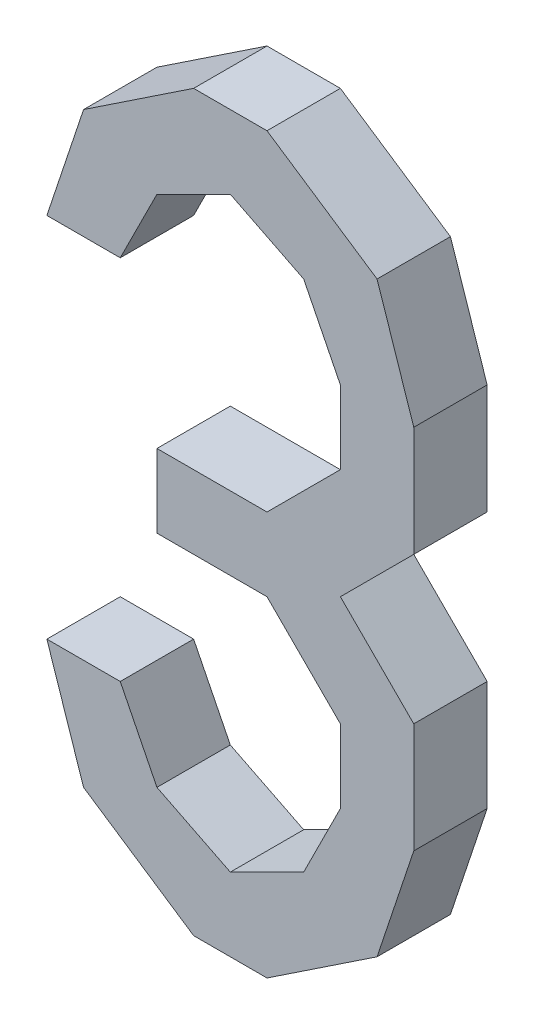
ISO-10303-21;
HEADER;
FILE_DESCRIPTION(('STEP AP214'),'2;1');
FILE_NAME('part.step','',(''),(''),'','','');
FILE_SCHEMA(('AUTOMOTIVE_DESIGN { 1 0 10303 214 1 1 1 1 }'));
ENDSEC;
DATA;
#1=APPLICATION_CONTEXT('core data for automotive mechanical design processes');
#2=APPLICATION_PROTOCOL_DEFINITION('international standard','automotive_design',2000,#1);
#3=PRODUCT_CONTEXT('',#1,'mechanical');
#4=PRODUCT('Part','Part','',(#3));
#5=PRODUCT_RELATED_PRODUCT_CATEGORY('part','',(#4));
#6=PRODUCT_DEFINITION_FORMATION('','',#4);
#7=PRODUCT_DEFINITION_CONTEXT('part definition',#1,'design');
#8=PRODUCT_DEFINITION('design','',#6,#7);
#9=PRODUCT_DEFINITION_SHAPE('','',#8);
#10=(LENGTH_UNIT() NAMED_UNIT(*) SI_UNIT(.MILLI.,.METRE.));
#11=(NAMED_UNIT(*) PLANE_ANGLE_UNIT() SI_UNIT($,.RADIAN.));
#12=(NAMED_UNIT(*) SI_UNIT($,.STERADIAN.) SOLID_ANGLE_UNIT());
#13=UNCERTAINTY_MEASURE_WITH_UNIT(LENGTH_MEASURE(1.E-05),#10,'distance_accuracy_value','');
#14=(GEOMETRIC_REPRESENTATION_CONTEXT(3) GLOBAL_UNCERTAINTY_ASSIGNED_CONTEXT((#13)) GLOBAL_UNIT_ASSIGNED_CONTEXT((#10,
#11,#12)) REPRESENTATION_CONTEXT('',''));
#15=CARTESIAN_POINT('',(0.,0.,0.));
#16=DIRECTION('',(0.,0.,1.));
#17=DIRECTION('',(1.,0.,0.));
#18=AXIS2_PLACEMENT_3D('',#15,#16,#17);
#19=CARTESIAN_POINT('',(-0.06349999999999,0.0635,0.));
#20=DIRECTION('',(0.,0.,1.));
#21=DIRECTION('',(1.,0.,0.));
#22=AXIS2_PLACEMENT_3D('',#19,#20,#21);
#23=PLANE('',#22);
#24=DIRECTION('',(-0.832050294337997,-0.554700196224998,0.));
#25=VECTOR('',#24,1.);
#26=CARTESIAN_POINT('',(-0.0508,0.1016,0.));
#27=LINE('',#26,#25);
#28=CARTESIAN_POINT('',(-0.0126999999999982,0.126999999999997,0.));
#29=VERTEX_POINT('',#28);
#30=CARTESIAN_POINT('',(-0.0507999999999977,0.101599999999999,0.));
#31=VERTEX_POINT('',#30);
#32=EDGE_CURVE('E376',#29,#31,#27,.T.);
#33=ORIENTED_EDGE('',*,*,#32,.F.);
#34=DIRECTION('',(1.,0.,0.));
#35=VECTOR('',#34,1.);
#36=CARTESIAN_POINT('',(-0.0127,0.127,0.));
#37=LINE('',#36,#35);
#38=CARTESIAN_POINT('',(0.01270000000001,0.127,0.));
#39=VERTEX_POINT('',#38);
#40=EDGE_CURVE('E371',#39,#29,#37,.F.);
#41=ORIENTED_EDGE('',*,*,#40,.F.);
#42=DIRECTION('',(-0.832050294337997,0.554700196224998,0.));
#43=VECTOR('',#42,1.);
#44=CARTESIAN_POINT('',(0.01270000000001,0.127,0.));
#45=LINE('',#44,#43);
#46=CARTESIAN_POINT('',(0.0508000000000118,0.101600000000003,0.));
#47=VERTEX_POINT('',#46);
#48=EDGE_CURVE('E366',#47,#39,#45,.T.);
#49=ORIENTED_EDGE('',*,*,#48,.F.);
#50=DIRECTION('',(-0.316227766016838,0.948683298050514,0.));
#51=VECTOR('',#50,1.);
#52=CARTESIAN_POINT('',(0.05080000000001,0.1016,0.));
#53=LINE('',#52,#51);
#54=CARTESIAN_POINT('',(0.0635000000000022,0.0635000000000008,0.));
#55=VERTEX_POINT('',#54);
#56=EDGE_CURVE('E361',#55,#47,#53,.T.);
#57=ORIENTED_EDGE('',*,*,#56,.F.);
#58=DIRECTION('',(0.,1.,0.));
#59=VECTOR('',#58,1.);
#60=CARTESIAN_POINT('',(0.0635,0.0635,0.));
#61=LINE('',#60,#59);
#62=CARTESIAN_POINT('',(0.0635,0.02540000000002,0.));
#63=VERTEX_POINT('',#62);
#64=EDGE_CURVE('E356',#63,#55,#61,.T.);
#65=ORIENTED_EDGE('',*,*,#64,.F.);
#66=DIRECTION('',(0.707106781186048,0.707106781187048,0.));
#67=VECTOR('',#66,1.);
#68=CARTESIAN_POINT('',(0.0635,0.02540000000002,0.));
#69=LINE('',#68,#67);
#70=CARTESIAN_POINT('',(0.038100000000002,0.,0.));
#71=VERTEX_POINT('',#70);
#72=EDGE_CURVE('E351',#71,#63,#69,.T.);
#73=ORIENTED_EDGE('',*,*,#72,.F.);
#74=DIRECTION('',(-0.707106781187048,0.707106781186048,0.));
#75=VECTOR('',#74,1.);
#76=CARTESIAN_POINT('',(0.0381,0.,0.));
#77=LINE('',#76,#75);
#78=CARTESIAN_POINT('',(0.0635000000000032,-0.0253999999999868,0.));
#79=VERTEX_POINT('',#78);
#80=EDGE_CURVE('E346',#79,#71,#77,.T.);
#81=ORIENTED_EDGE('',*,*,#80,.F.);
#82=DIRECTION('',(0.,1.,0.));
#83=VECTOR('',#82,1.);
#84=CARTESIAN_POINT('',(0.0635,-0.02539999999999,0.));
#85=LINE('',#84,#83);
#86=CARTESIAN_POINT('',(0.0635,-0.0635,0.));
#87=VERTEX_POINT('',#86);
#88=EDGE_CURVE('E341',#87,#79,#85,.T.);
#89=ORIENTED_EDGE('',*,*,#88,.F.);
#90=DIRECTION('',(0.316227766016838,0.948683298050514,0.));
#91=VECTOR('',#90,1.);
#92=CARTESIAN_POINT('',(0.0635,-0.0635,0.));
#93=LINE('',#92,#91);
#94=CARTESIAN_POINT('',(0.0508000000000077,-0.101599999999999,0.));
#95=VERTEX_POINT('',#94);
#96=EDGE_CURVE('E336',#95,#87,#93,.T.);
#97=ORIENTED_EDGE('',*,*,#96,.F.);
#98=DIRECTION('',(0.832050294337997,0.554700196224998,0.));
#99=VECTOR('',#98,1.);
#100=CARTESIAN_POINT('',(0.05080000000001,-0.1016,0.));
#101=LINE('',#100,#99);
#102=CARTESIAN_POINT('',(0.0127000000000083,-0.126999999999997,0.));
#103=VERTEX_POINT('',#102);
#104=EDGE_CURVE('E331',#103,#95,#101,.T.);
#105=ORIENTED_EDGE('',*,*,#104,.F.);
#106=DIRECTION('',(1.,0.,0.));
#107=VECTOR('',#106,1.);
#108=CARTESIAN_POINT('',(0.01270000000001,-0.127,0.));
#109=LINE('',#108,#107);
#110=CARTESIAN_POINT('',(-0.0127,-0.127,0.));
#111=VERTEX_POINT('',#110);
#112=EDGE_CURVE('E326',#111,#103,#109,.T.);
#113=ORIENTED_EDGE('',*,*,#112,.F.);
#114=DIRECTION('',(0.832050294337997,-0.554700196224998,0.));
#115=VECTOR('',#114,1.);
#116=CARTESIAN_POINT('',(-0.0127,-0.127,0.));
#117=LINE('',#116,#115);
#118=CARTESIAN_POINT('',(-0.0508000000000018,-0.101600000000003,0.));
#119=VERTEX_POINT('',#118);
#120=EDGE_CURVE('E321',#119,#111,#117,.T.);
#121=ORIENTED_EDGE('',*,*,#120,.F.);
#122=DIRECTION('',(0.316227766016838,-0.948683298050514,0.));
#123=VECTOR('',#122,1.);
#124=CARTESIAN_POINT('',(-0.0508,-0.1016,0.));
#125=LINE('',#124,#123);
#126=CARTESIAN_POINT('',(-0.0634999999999922,-0.0635000000000008,0.));
#127=VERTEX_POINT('',#126);
#128=EDGE_CURVE('E316',#127,#119,#125,.T.);
#129=ORIENTED_EDGE('',*,*,#128,.F.);
#130=DIRECTION('',(1.,0.,0.));
#131=VECTOR('',#130,1.);
#132=CARTESIAN_POINT('',(-0.06349999999999,-0.0635,0.));
#133=LINE('',#132,#131);
#134=CARTESIAN_POINT('',(-0.0381,-0.0635,0.));
#135=VERTEX_POINT('',#134);
#136=EDGE_CURVE('E311',#135,#127,#133,.F.);
#137=ORIENTED_EDGE('',*,*,#136,.F.);
#138=DIRECTION('',(-0.447213595499958,0.894427190999916,0.));
#139=VECTOR('',#138,1.);
#140=CARTESIAN_POINT('',(-0.0381,-0.0635,0.));
#141=LINE('',#140,#139);
#142=CARTESIAN_POINT('',(-0.025399999999992,-0.088900000000001,0.));
#143=VERTEX_POINT('',#142);
#144=EDGE_CURVE('E306',#143,#135,#141,.T.);
#145=ORIENTED_EDGE('',*,*,#144,.F.);
#146=DIRECTION('',(-0.894427190999916,0.447213595499958,0.));
#147=VECTOR('',#146,1.);
#148=CARTESIAN_POINT('',(-0.02539999999999,-0.0889,0.));
#149=LINE('',#148,#147);
#150=CARTESIAN_POINT('',(0.,-0.101599999999999,0.));
#151=VERTEX_POINT('',#150);
#152=EDGE_CURVE('E301',#151,#143,#149,.T.);
#153=ORIENTED_EDGE('',*,*,#152,.F.);
#154=DIRECTION('',(-0.894427190999916,-0.447213595499958,0.));
#155=VECTOR('',#154,1.);
#156=CARTESIAN_POINT('',(0.,-0.1016,0.));
#157=LINE('',#156,#155);
#158=CARTESIAN_POINT('',(0.0254,-0.0889,0.));
#159=VERTEX_POINT('',#158);
#160=EDGE_CURVE('E296',#159,#151,#157,.T.);
#161=ORIENTED_EDGE('',*,*,#160,.F.);
#162=DIRECTION('',(-0.447213595499958,-0.894427190999916,0.));
#163=VECTOR('',#162,1.);
#164=CARTESIAN_POINT('',(0.0254,-0.0889,0.));
#165=LINE('',#164,#163);
#166=CARTESIAN_POINT('',(0.0381,-0.0635,0.));
#167=VERTEX_POINT('',#166);
#168=EDGE_CURVE('E291',#167,#159,#165,.T.);
#169=ORIENTED_EDGE('',*,*,#168,.F.);
#170=DIRECTION('',(0.,1.,0.));
#171=VECTOR('',#170,1.);
#172=CARTESIAN_POINT('',(0.0381,-0.0635,0.));
#173=LINE('',#172,#171);
#174=CARTESIAN_POINT('',(0.0381,-0.03809999999999,0.));
#175=VERTEX_POINT('',#174);
#176=EDGE_CURVE('E286',#175,#167,#173,.F.);
#177=ORIENTED_EDGE('',*,*,#176,.F.);
#178=DIRECTION('',(0.707106781186548,-0.707106781186548,0.));
#179=VECTOR('',#178,1.);
#180=CARTESIAN_POINT('',(0.0381,-0.03809999999999,0.));
#181=LINE('',#180,#179);
#182=CARTESIAN_POINT('',(0.01270000000001,-0.0127,0.));
#183=VERTEX_POINT('',#182);
#184=EDGE_CURVE('E281',#183,#175,#181,.T.);
#185=ORIENTED_EDGE('',*,*,#184,.F.);
#186=DIRECTION('',(1.,0.,0.));
#187=VECTOR('',#186,1.);
#188=CARTESIAN_POINT('',(0.01270000000001,-0.0127,0.));
#189=LINE('',#188,#187);
#190=CARTESIAN_POINT('',(-0.02539999999999,-0.0127,0.));
#191=VERTEX_POINT('',#190);
#192=EDGE_CURVE('E276',#191,#183,#189,.T.);
#193=ORIENTED_EDGE('',*,*,#192,.F.);
#194=DIRECTION('',(0.,1.,0.));
#195=VECTOR('',#194,1.);
#196=CARTESIAN_POINT('',(-0.02539999999999,-0.0127,0.));
#197=LINE('',#196,#195);
#198=CARTESIAN_POINT('',(-0.02539999999999,0.0127,0.));
#199=VERTEX_POINT('',#198);
#200=EDGE_CURVE('E271',#199,#191,#197,.F.);
#201=ORIENTED_EDGE('',*,*,#200,.F.);
#202=DIRECTION('',(1.,0.,0.));
#203=VECTOR('',#202,1.);
#204=CARTESIAN_POINT('',(-0.02539999999999,0.0127,0.));
#205=LINE('',#204,#203);
#206=CARTESIAN_POINT('',(0.01270000000001,0.0127,0.));
#207=VERTEX_POINT('',#206);
#208=EDGE_CURVE('E266',#207,#199,#205,.F.);
#209=ORIENTED_EDGE('',*,*,#208,.F.);
#210=DIRECTION('',(-0.707106781186048,-0.707106781187048,0.));
#211=VECTOR('',#210,1.);
#212=CARTESIAN_POINT('',(0.01270000000001,0.0127,0.));
#213=LINE('',#212,#211);
#214=CARTESIAN_POINT('',(0.038099999999998,0.038100000000012,0.));
#215=VERTEX_POINT('',#214);
#216=EDGE_CURVE('E261',#215,#207,#213,.T.);
#217=ORIENTED_EDGE('',*,*,#216,.F.);
#218=DIRECTION('',(0.,1.,0.));
#219=VECTOR('',#218,1.);
#220=CARTESIAN_POINT('',(0.0381,0.03810000000001,0.));
#221=LINE('',#220,#219);
#222=CARTESIAN_POINT('',(0.0381,0.0635,0.));
#223=VERTEX_POINT('',#222);
#224=EDGE_CURVE('E256',#223,#215,#221,.F.);
#225=ORIENTED_EDGE('',*,*,#224,.F.);
#226=DIRECTION('',(0.447213595499958,-0.894427190999916,0.));
#227=VECTOR('',#226,1.);
#228=CARTESIAN_POINT('',(0.0381,0.0635,0.));
#229=LINE('',#228,#227);
#230=CARTESIAN_POINT('',(0.0254,0.0889,0.));
#231=VERTEX_POINT('',#230);
#232=EDGE_CURVE('E251',#231,#223,#229,.T.);
#233=ORIENTED_EDGE('',*,*,#232,.F.);
#234=DIRECTION('',(0.894427190999516,-0.447213595500758,0.));
#235=VECTOR('',#234,1.);
#236=CARTESIAN_POINT('',(0.0254,0.0889,0.));
#237=LINE('',#236,#235);
#238=CARTESIAN_POINT('',(0.,0.101600000000006,0.));
#239=VERTEX_POINT('',#238);
#240=EDGE_CURVE('E246',#239,#231,#237,.T.);
#241=ORIENTED_EDGE('',*,*,#240,.F.);
#242=DIRECTION('',(0.894427190999516,0.447213595500758,0.));
#243=VECTOR('',#242,1.);
#244=CARTESIAN_POINT('',(0.,0.1016,0.));
#245=LINE('',#244,#243);
#246=CARTESIAN_POINT('',(-0.0253999999999877,0.0888999999999953,0.));
#247=VERTEX_POINT('',#246);
#248=EDGE_CURVE('E232',#247,#239,#245,.T.);
#249=ORIENTED_EDGE('',*,*,#248,.F.);
#250=DIRECTION('',(0.447213595499958,0.894427190999916,0.));
#251=VECTOR('',#250,1.);
#252=CARTESIAN_POINT('',(-0.02539999999999,0.0889,0.));
#253=LINE('',#252,#251);
#254=CARTESIAN_POINT('',(-0.038099999999998,0.063499999999999,0.));
#255=VERTEX_POINT('',#254);
#256=EDGE_CURVE('E217',#255,#247,#253,.T.);
#257=ORIENTED_EDGE('',*,*,#256,.F.);
#258=DIRECTION('',(1.,0.,0.));
#259=VECTOR('',#258,1.);
#260=CARTESIAN_POINT('',(-0.0381,0.0635,0.));
#261=LINE('',#260,#259);
#262=CARTESIAN_POINT('',(-0.06349999999999,0.0635,0.));
#263=VERTEX_POINT('',#262);
#264=EDGE_CURVE('E20',#263,#255,#261,.T.);
#265=ORIENTED_EDGE('',*,*,#264,.F.);
#266=DIRECTION('',(-0.316227766016838,-0.948683298050514,0.));
#267=VECTOR('',#266,1.);
#268=CARTESIAN_POINT('',(-0.06349999999999,0.0635,0.));
#269=LINE('',#268,#267);
#270=EDGE_CURVE('E380',#31,#263,#269,.T.);
#271=ORIENTED_EDGE('',*,*,#270,.F.);
#272=EDGE_LOOP('',(#33,#41,#49,#57,#65,#73,#81,#89,#97,#105,#113,#121,#129,#137,#145,#153,#161,
#169,#177,#185,#193,#201,#209,#217,#225,#233,#241,#249,#257,#265,#271));
#273=FACE_BOUND('',#272,.T.);
#274=ADVANCED_FACE('F17',(#273),#23,.F.);
#275=CARTESIAN_POINT('',(-0.0381,0.0635,0.));
#276=DIRECTION('',(0.,-1.,0.));
#277=DIRECTION('',(0.,0.,-1.));
#278=AXIS2_PLACEMENT_3D('',#275,#276,#277);
#279=PLANE('',#278);
#280=DIRECTION('',(0.,0.,1.));
#281=VECTOR('',#280,1.);
#282=CARTESIAN_POINT('',(-0.06349999999999,0.0635,0.));
#283=LINE('',#282,#281);
#284=CARTESIAN_POINT('',(-0.06349999999999,0.0635,0.0254));
#285=VERTEX_POINT('',#284);
#286=EDGE_CURVE('E226',#263,#285,#283,.T.);
#287=ORIENTED_EDGE('',*,*,#286,.F.);
#288=ORIENTED_EDGE('',*,*,#264,.T.);
#289=DIRECTION('',(0.,0.,1.));
#290=VECTOR('',#289,1.);
#291=CARTESIAN_POINT('',(-0.038099999999992,0.063499999999996,0.));
#292=LINE('',#291,#290);
#293=CARTESIAN_POINT('',(-0.038099999999998,0.063499999999999,0.0254));
#294=VERTEX_POINT('',#293);
#295=EDGE_CURVE('E223',#294,#255,#292,.F.);
#296=ORIENTED_EDGE('',*,*,#295,.F.);
#297=DIRECTION('',(1.,0.,0.));
#298=VECTOR('',#297,1.);
#299=CARTESIAN_POINT('',(-0.06349999999999,0.0635,0.0254));
#300=LINE('',#299,#298);
#301=EDGE_CURVE('E382',#285,#294,#300,.T.);
#302=ORIENTED_EDGE('',*,*,#301,.F.);
#303=EDGE_LOOP('',(#287,#288,#296,#302));
#304=FACE_BOUND('',#303,.T.);
#305=ADVANCED_FACE('F222',(#304),#279,.T.);
#306=CARTESIAN_POINT('',(-0.02539999999999,0.0889,0.));
#307=DIRECTION('',(0.894427190999916,-0.447213595499958,0.));
#308=DIRECTION('',(0.447213595499958,0.894427190999916,0.));
#309=AXIS2_PLACEMENT_3D('',#306,#307,#308);
#310=PLANE('',#309);
#311=ORIENTED_EDGE('',*,*,#295,.T.);
#312=ORIENTED_EDGE('',*,*,#256,.T.);
#313=DIRECTION('',(0.,0.,1.));
#314=VECTOR('',#313,1.);
#315=CARTESIAN_POINT('',(-0.0253999999999806,0.0888999999999813,0.));
#316=LINE('',#315,#314);
#317=CARTESIAN_POINT('',(-0.0253999999999877,0.0888999999999953,0.0254));
#318=VERTEX_POINT('',#317);
#319=EDGE_CURVE('E234',#318,#247,#316,.F.);
#320=ORIENTED_EDGE('',*,*,#319,.F.);
#321=DIRECTION('',(0.44721359550024,0.894427190999775,0.));
#322=VECTOR('',#321,1.);
#323=CARTESIAN_POINT('',(-0.0381,0.0635,0.0254));
#324=LINE('',#323,#322);
#325=EDGE_CURVE('E238',#294,#318,#324,.T.);
#326=ORIENTED_EDGE('',*,*,#325,.F.);
#327=EDGE_LOOP('',(#311,#312,#320,#326));
#328=FACE_BOUND('',#327,.T.);
#329=ADVANCED_FACE('F236',(#328),#310,.T.);
#330=CARTESIAN_POINT('',(0.,0.1016,0.));
#331=DIRECTION('',(0.447213595500758,-0.894427190999516,0.));
#332=DIRECTION('',(0.894427190999516,0.447213595500758,0.));
#333=AXIS2_PLACEMENT_3D('',#330,#331,#332);
#334=PLANE('',#333);
#335=ORIENTED_EDGE('',*,*,#319,.T.);
#336=ORIENTED_EDGE('',*,*,#248,.T.);
#337=DIRECTION('',(0.,0.,1.));
#338=VECTOR('',#337,1.);
#339=CARTESIAN_POINT('',(0.,0.101600000000023,0.));
#340=LINE('',#339,#338);
#341=CARTESIAN_POINT('',(0.,0.101600000000006,0.0254));
#342=VERTEX_POINT('',#341);
#343=EDGE_CURVE('E243',#342,#239,#340,.F.);
#344=ORIENTED_EDGE('',*,*,#343,.F.);
#345=DIRECTION('',(0.894427190999845,0.447213595500099,0.));
#346=VECTOR('',#345,1.);
#347=CARTESIAN_POINT('',(-0.02539999999999,0.0889,0.0254));
#348=LINE('',#347,#346);
#349=EDGE_CURVE('E385',#318,#342,#348,.T.);
#350=ORIENTED_EDGE('',*,*,#349,.F.);
#351=EDGE_LOOP('',(#335,#336,#344,#350));
#352=FACE_BOUND('',#351,.T.);
#353=ADVANCED_FACE('F588',(#352),#334,.T.);
#354=CARTESIAN_POINT('',(0.0254,0.0889,0.));
#355=DIRECTION('',(-0.447213595500758,-0.894427190999516,0.));
#356=DIRECTION('',(0.894427190999516,-0.447213595500758,0.));
#357=AXIS2_PLACEMENT_3D('',#354,#355,#356);
#358=PLANE('',#357);
#359=ORIENTED_EDGE('',*,*,#343,.T.);
#360=ORIENTED_EDGE('',*,*,#240,.T.);
#361=DIRECTION('',(0.,0.,1.));
#362=VECTOR('',#361,1.);
#363=CARTESIAN_POINT('',(0.0254,0.0889,0.));
#364=LINE('',#363,#362);
#365=CARTESIAN_POINT('',(0.0254,0.0889,0.0254));
#366=VERTEX_POINT('',#365);
#367=EDGE_CURVE('E248',#366,#231,#364,.F.);
#368=ORIENTED_EDGE('',*,*,#367,.F.);
#369=DIRECTION('',(0.894427190999916,-0.447213595499958,0.));
#370=VECTOR('',#369,1.);
#371=CARTESIAN_POINT('',(0.,0.1016,0.0254));
#372=LINE('',#371,#370);
#373=EDGE_CURVE('E388',#342,#366,#372,.T.);
#374=ORIENTED_EDGE('',*,*,#373,.F.);
#375=EDGE_LOOP('',(#359,#360,#368,#374));
#376=FACE_BOUND('',#375,.T.);
#377=ADVANCED_FACE('F584',(#376),#358,.T.);
#378=CARTESIAN_POINT('',(0.0381,0.0635,0.));
#379=DIRECTION('',(-0.894427190999916,-0.447213595499958,0.));
#380=DIRECTION('',(0.447213595499958,-0.894427190999916,0.));
#381=AXIS2_PLACEMENT_3D('',#378,#379,#380);
#382=PLANE('',#381);
#383=ORIENTED_EDGE('',*,*,#367,.T.);
#384=ORIENTED_EDGE('',*,*,#232,.T.);
#385=DIRECTION('',(0.,0.,1.));
#386=VECTOR('',#385,1.);
#387=CARTESIAN_POINT('',(0.0381,0.0635,0.));
#388=LINE('',#387,#386);
#389=CARTESIAN_POINT('',(0.0381,0.0635,0.0254));
#390=VERTEX_POINT('',#389);
#391=EDGE_CURVE('E253',#390,#223,#388,.F.);
#392=ORIENTED_EDGE('',*,*,#391,.F.);
#393=DIRECTION('',(0.447213595499958,-0.894427190999916,0.));
#394=VECTOR('',#393,1.);
#395=CARTESIAN_POINT('',(0.0254,0.0889,0.0254));
#396=LINE('',#395,#394);
#397=EDGE_CURVE('E391',#366,#390,#396,.T.);
#398=ORIENTED_EDGE('',*,*,#397,.F.);
#399=EDGE_LOOP('',(#383,#384,#392,#398));
#400=FACE_BOUND('',#399,.T.);
#401=ADVANCED_FACE('F580',(#400),#382,.T.);
#402=CARTESIAN_POINT('',(0.0381,0.03810000000001,0.));
#403=DIRECTION('',(-1.,0.,0.));
#404=DIRECTION('',(0.,0.,1.));
#405=AXIS2_PLACEMENT_3D('',#402,#403,#404);
#406=PLANE('',#405);
#407=ORIENTED_EDGE('',*,*,#391,.T.);
#408=ORIENTED_EDGE('',*,*,#224,.T.);
#409=DIRECTION('',(0.,0.,1.));
#410=VECTOR('',#409,1.);
#411=CARTESIAN_POINT('',(0.038099999999992,0.038100000000018,0.));
#412=LINE('',#411,#410);
#413=CARTESIAN_POINT('',(0.038099999999998,0.038100000000012,0.0254));
#414=VERTEX_POINT('',#413);
#415=EDGE_CURVE('E258',#414,#215,#412,.F.);
#416=ORIENTED_EDGE('',*,*,#415,.F.);
#417=DIRECTION('',(0.,1.,0.));
#418=VECTOR('',#417,1.);
#419=CARTESIAN_POINT('',(0.0381,0.0635,0.0254));
#420=LINE('',#419,#418);
#421=EDGE_CURVE('E394',#390,#414,#420,.F.);
#422=ORIENTED_EDGE('',*,*,#421,.F.);
#423=EDGE_LOOP('',(#407,#408,#416,#422));
#424=FACE_BOUND('',#423,.T.);
#425=ADVANCED_FACE('F576',(#424),#406,.T.);
#426=CARTESIAN_POINT('',(0.01270000000001,0.0127,0.));
#427=DIRECTION('',(-0.707106781187048,0.707106781186048,0.));
#428=DIRECTION('',(-0.707106781186048,-0.707106781187048,0.));
#429=AXIS2_PLACEMENT_3D('',#426,#427,#428);
#430=PLANE('',#429);
#431=ORIENTED_EDGE('',*,*,#415,.T.);
#432=ORIENTED_EDGE('',*,*,#216,.T.);
#433=DIRECTION('',(0.,0.,1.));
#434=VECTOR('',#433,1.);
#435=CARTESIAN_POINT('',(0.01270000000001,0.0127,0.));
#436=LINE('',#435,#434);
#437=CARTESIAN_POINT('',(0.01270000000001,0.0127,0.0254));
#438=VERTEX_POINT('',#437);
#439=EDGE_CURVE('E263',#438,#207,#436,.F.);
#440=ORIENTED_EDGE('',*,*,#439,.F.);
#441=DIRECTION('',(-0.707106781186269,-0.707106781186826,0.));
#442=VECTOR('',#441,1.);
#443=CARTESIAN_POINT('',(0.0381,0.03810000000001,0.0254));
#444=LINE('',#443,#442);
#445=EDGE_CURVE('E397',#414,#438,#444,.T.);
#446=ORIENTED_EDGE('',*,*,#445,.F.);
#447=EDGE_LOOP('',(#431,#432,#440,#446));
#448=FACE_BOUND('',#447,.T.);
#449=ADVANCED_FACE('F572',(#448),#430,.T.);
#450=CARTESIAN_POINT('',(-0.02539999999999,0.0127,0.));
#451=DIRECTION('',(0.,1.,0.));
#452=DIRECTION('',(0.,0.,1.));
#453=AXIS2_PLACEMENT_3D('',#450,#451,#452);
#454=PLANE('',#453);
#455=ORIENTED_EDGE('',*,*,#439,.T.);
#456=ORIENTED_EDGE('',*,*,#208,.T.);
#457=DIRECTION('',(0.,0.,1.));
#458=VECTOR('',#457,1.);
#459=CARTESIAN_POINT('',(-0.02539999999999,0.0127,0.));
#460=LINE('',#459,#458);
#461=CARTESIAN_POINT('',(-0.02539999999999,0.0127,0.0254));
#462=VERTEX_POINT('',#461);
#463=EDGE_CURVE('E268',#462,#199,#460,.F.);
#464=ORIENTED_EDGE('',*,*,#463,.F.);
#465=DIRECTION('',(1.,0.,0.));
#466=VECTOR('',#465,1.);
#467=CARTESIAN_POINT('',(-0.06349999999999,0.0127,0.0254));
#468=LINE('',#467,#466);
#469=EDGE_CURVE('E400',#438,#462,#468,.F.);
#470=ORIENTED_EDGE('',*,*,#469,.F.);
#471=EDGE_LOOP('',(#455,#456,#464,#470));
#472=FACE_BOUND('',#471,.T.);
#473=ADVANCED_FACE('F568',(#472),#454,.T.);
#474=CARTESIAN_POINT('',(-0.02539999999999,-0.0127,0.));
#475=DIRECTION('',(-1.,0.,0.));
#476=DIRECTION('',(0.,0.,1.));
#477=AXIS2_PLACEMENT_3D('',#474,#475,#476);
#478=PLANE('',#477);
#479=ORIENTED_EDGE('',*,*,#463,.T.);
#480=ORIENTED_EDGE('',*,*,#200,.T.);
#481=DIRECTION('',(0.,0.,-1.));
#482=VECTOR('',#481,1.);
#483=CARTESIAN_POINT('',(-0.02539999999999,-0.0127,0.));
#484=LINE('',#483,#482);
#485=CARTESIAN_POINT('',(-0.02539999999999,-0.0127,0.0254));
#486=VERTEX_POINT('',#485);
#487=EDGE_CURVE('E273',#486,#191,#484,.T.);
#488=ORIENTED_EDGE('',*,*,#487,.F.);
#489=DIRECTION('',(0.,1.,0.));
#490=VECTOR('',#489,1.);
#491=CARTESIAN_POINT('',(-0.02539999999999,0.0635,0.0254));
#492=LINE('',#491,#490);
#493=EDGE_CURVE('E403',#462,#486,#492,.F.);
#494=ORIENTED_EDGE('',*,*,#493,.F.);
#495=EDGE_LOOP('',(#479,#480,#488,#494));
#496=FACE_BOUND('',#495,.T.);
#497=ADVANCED_FACE('F564',(#496),#478,.T.);
#498=CARTESIAN_POINT('',(0.01270000000001,-0.0127,0.));
#499=DIRECTION('',(0.,-1.,0.));
#500=DIRECTION('',(0.,0.,-1.));
#501=AXIS2_PLACEMENT_3D('',#498,#499,#500);
#502=PLANE('',#501);
#503=ORIENTED_EDGE('',*,*,#487,.T.);
#504=ORIENTED_EDGE('',*,*,#192,.T.);
#505=DIRECTION('',(0.,0.,1.));
#506=VECTOR('',#505,1.);
#507=CARTESIAN_POINT('',(0.01270000000001,-0.0127,0.));
#508=LINE('',#507,#506);
#509=CARTESIAN_POINT('',(0.01270000000001,-0.0127,0.0254));
#510=VERTEX_POINT('',#509);
#511=EDGE_CURVE('E278',#510,#183,#508,.F.);
#512=ORIENTED_EDGE('',*,*,#511,.F.);
#513=DIRECTION('',(1.,0.,0.));
#514=VECTOR('',#513,1.);
#515=CARTESIAN_POINT('',(-0.06349999999999,-0.0127,0.0254));
#516=LINE('',#515,#514);
#517=EDGE_CURVE('E406',#486,#510,#516,.T.);
#518=ORIENTED_EDGE('',*,*,#517,.F.);
#519=EDGE_LOOP('',(#503,#504,#512,#518));
#520=FACE_BOUND('',#519,.T.);
#521=ADVANCED_FACE('F560',(#520),#502,.T.);
#522=CARTESIAN_POINT('',(0.0381,-0.03809999999999,0.));
#523=DIRECTION('',(-0.707106781186548,-0.707106781186548,0.));
#524=DIRECTION('',(0.707106781186548,-0.707106781186548,0.));
#525=AXIS2_PLACEMENT_3D('',#522,#523,#524);
#526=PLANE('',#525);
#527=ORIENTED_EDGE('',*,*,#511,.T.);
#528=ORIENTED_EDGE('',*,*,#184,.T.);
#529=DIRECTION('',(0.,0.,1.));
#530=VECTOR('',#529,1.);
#531=CARTESIAN_POINT('',(0.0381,-0.03809999999999,0.));
#532=LINE('',#531,#530);
#533=CARTESIAN_POINT('',(0.0381,-0.03809999999999,0.0254));
#534=VERTEX_POINT('',#533);
#535=EDGE_CURVE('E283',#534,#175,#532,.F.);
#536=ORIENTED_EDGE('',*,*,#535,.F.);
#537=DIRECTION('',(0.707106781186547,-0.707106781186547,0.));
#538=VECTOR('',#537,1.);
#539=CARTESIAN_POINT('',(0.01270000000001,-0.0127,0.0254));
#540=LINE('',#539,#538);
#541=EDGE_CURVE('E409',#510,#534,#540,.T.);
#542=ORIENTED_EDGE('',*,*,#541,.F.);
#543=EDGE_LOOP('',(#527,#528,#536,#542));
#544=FACE_BOUND('',#543,.T.);
#545=ADVANCED_FACE('F556',(#544),#526,.T.);
#546=CARTESIAN_POINT('',(0.0381,-0.0635,0.));
#547=DIRECTION('',(-1.,0.,0.));
#548=DIRECTION('',(0.,0.,1.));
#549=AXIS2_PLACEMENT_3D('',#546,#547,#548);
#550=PLANE('',#549);
#551=ORIENTED_EDGE('',*,*,#535,.T.);
#552=ORIENTED_EDGE('',*,*,#176,.T.);
#553=DIRECTION('',(0.,0.,1.));
#554=VECTOR('',#553,1.);
#555=CARTESIAN_POINT('',(0.0381,-0.0635,0.));
#556=LINE('',#555,#554);
#557=CARTESIAN_POINT('',(0.0381,-0.0635,0.0254));
#558=VERTEX_POINT('',#557);
#559=EDGE_CURVE('E288',#558,#167,#556,.F.);
#560=ORIENTED_EDGE('',*,*,#559,.F.);
#561=DIRECTION('',(0.,1.,0.));
#562=VECTOR('',#561,1.);
#563=CARTESIAN_POINT('',(0.0381,0.0635,0.0254));
#564=LINE('',#563,#562);
#565=EDGE_CURVE('E412',#534,#558,#564,.F.);
#566=ORIENTED_EDGE('',*,*,#565,.F.);
#567=EDGE_LOOP('',(#551,#552,#560,#566));
#568=FACE_BOUND('',#567,.T.);
#569=ADVANCED_FACE('F552',(#568),#550,.T.);
#570=CARTESIAN_POINT('',(0.0254,-0.0889,0.));
#571=DIRECTION('',(-0.894427190999916,0.447213595499958,0.));
#572=DIRECTION('',(-0.447213595499958,-0.894427190999916,0.));
#573=AXIS2_PLACEMENT_3D('',#570,#571,#572);
#574=PLANE('',#573);
#575=ORIENTED_EDGE('',*,*,#559,.T.);
#576=ORIENTED_EDGE('',*,*,#168,.T.);
#577=DIRECTION('',(0.,0.,1.));
#578=VECTOR('',#577,1.);
#579=CARTESIAN_POINT('',(0.0254,-0.0889,0.));
#580=LINE('',#579,#578);
#581=CARTESIAN_POINT('',(0.0254,-0.0889,0.0254));
#582=VERTEX_POINT('',#581);
#583=EDGE_CURVE('E293',#582,#159,#580,.F.);
#584=ORIENTED_EDGE('',*,*,#583,.F.);
#585=DIRECTION('',(-0.447213595499958,-0.894427190999916,0.));
#586=VECTOR('',#585,1.);
#587=CARTESIAN_POINT('',(0.0381,-0.0635,0.0254));
#588=LINE('',#587,#586);
#589=EDGE_CURVE('E415',#558,#582,#588,.T.);
#590=ORIENTED_EDGE('',*,*,#589,.F.);
#591=EDGE_LOOP('',(#575,#576,#584,#590));
#592=FACE_BOUND('',#591,.T.);
#593=ADVANCED_FACE('F548',(#592),#574,.T.);
#594=CARTESIAN_POINT('',(0.,-0.1016,0.));
#595=DIRECTION('',(-0.447213595499958,0.894427190999916,0.));
#596=DIRECTION('',(-0.894427190999916,-0.447213595499958,0.));
#597=AXIS2_PLACEMENT_3D('',#594,#595,#596);
#598=PLANE('',#597);
#599=ORIENTED_EDGE('',*,*,#583,.T.);
#600=ORIENTED_EDGE('',*,*,#160,.T.);
#601=DIRECTION('',(0.,0.,1.));
#602=VECTOR('',#601,1.);
#603=CARTESIAN_POINT('',(0.,-0.101599999999996,0.));
#604=LINE('',#603,#602);
#605=CARTESIAN_POINT('',(0.,-0.101599999999999,0.0254));
#606=VERTEX_POINT('',#605);
#607=EDGE_CURVE('E298',#606,#151,#604,.F.);
#608=ORIENTED_EDGE('',*,*,#607,.F.);
#609=DIRECTION('',(-0.894427190999916,-0.447213595499958,0.));
#610=VECTOR('',#609,1.);
#611=CARTESIAN_POINT('',(0.0254,-0.0889,0.0254));
#612=LINE('',#611,#610);
#613=EDGE_CURVE('E418',#582,#606,#612,.T.);
#614=ORIENTED_EDGE('',*,*,#613,.F.);
#615=EDGE_LOOP('',(#599,#600,#608,#614));
#616=FACE_BOUND('',#615,.T.);
#617=ADVANCED_FACE('F544',(#616),#598,.T.);
#618=CARTESIAN_POINT('',(-0.02539999999999,-0.0889,0.));
#619=DIRECTION('',(0.447213595499958,0.894427190999916,0.));
#620=DIRECTION('',(-0.894427190999916,0.447213595499958,0.));
#621=AXIS2_PLACEMENT_3D('',#618,#619,#620);
#622=PLANE('',#621);
#623=ORIENTED_EDGE('',*,*,#607,.T.);
#624=ORIENTED_EDGE('',*,*,#152,.T.);
#625=DIRECTION('',(0.,0.,1.));
#626=VECTOR('',#625,1.);
#627=CARTESIAN_POINT('',(-0.025399999999998,-0.088900000000004,0.));
#628=LINE('',#627,#626);
#629=CARTESIAN_POINT('',(-0.025399999999992,-0.088900000000001,0.0254));
#630=VERTEX_POINT('',#629);
#631=EDGE_CURVE('E303',#630,#143,#628,.F.);
#632=ORIENTED_EDGE('',*,*,#631,.F.);
#633=DIRECTION('',(-0.894427190999846,0.447213595500098,0.));
#634=VECTOR('',#633,1.);
#635=CARTESIAN_POINT('',(0.,-0.1016,0.0254));
#636=LINE('',#635,#634);
#637=EDGE_CURVE('E421',#606,#630,#636,.T.);
#638=ORIENTED_EDGE('',*,*,#637,.F.);
#639=EDGE_LOOP('',(#623,#624,#632,#638));
#640=FACE_BOUND('',#639,.T.);
#641=ADVANCED_FACE('F540',(#640),#622,.T.);
#642=CARTESIAN_POINT('',(-0.0381,-0.0635,0.));
#643=DIRECTION('',(0.894427190999916,0.447213595499958,0.));
#644=DIRECTION('',(-0.447213595499958,0.894427190999916,0.));
#645=AXIS2_PLACEMENT_3D('',#642,#643,#644);
#646=PLANE('',#645);
#647=ORIENTED_EDGE('',*,*,#631,.T.);
#648=ORIENTED_EDGE('',*,*,#144,.T.);
#649=DIRECTION('',(0.,0.,1.));
#650=VECTOR('',#649,1.);
#651=CARTESIAN_POINT('',(-0.0381,-0.0635,0.));
#652=LINE('',#651,#650);
#653=CARTESIAN_POINT('',(-0.0381,-0.0635,0.0254));
#654=VERTEX_POINT('',#653);
#655=EDGE_CURVE('E308',#654,#135,#652,.F.);
#656=ORIENTED_EDGE('',*,*,#655,.F.);
#657=DIRECTION('',(-0.44721359550024,0.894427190999775,0.));
#658=VECTOR('',#657,1.);
#659=CARTESIAN_POINT('',(-0.02539999999999,-0.0889,0.0254));
#660=LINE('',#659,#658);
#661=EDGE_CURVE('E424',#630,#654,#660,.T.);
#662=ORIENTED_EDGE('',*,*,#661,.F.);
#663=EDGE_LOOP('',(#647,#648,#656,#662));
#664=FACE_BOUND('',#663,.T.);
#665=ADVANCED_FACE('F536',(#664),#646,.T.);
#666=CARTESIAN_POINT('',(-0.06349999999999,-0.0635,0.));
#667=DIRECTION('',(0.,1.,0.));
#668=DIRECTION('',(0.,0.,1.));
#669=AXIS2_PLACEMENT_3D('',#666,#667,#668);
#670=PLANE('',#669);
#671=ORIENTED_EDGE('',*,*,#655,.T.);
#672=ORIENTED_EDGE('',*,*,#136,.T.);
#673=DIRECTION('',(0.,0.,1.));
#674=VECTOR('',#673,1.);
#675=CARTESIAN_POINT('',(-0.063499999999999,-0.063500000000003,0.));
#676=LINE('',#675,#674);
#677=CARTESIAN_POINT('',(-0.0634999999999922,-0.0635000000000008,0.0254));
#678=VERTEX_POINT('',#677);
#679=EDGE_CURVE('E313',#678,#127,#676,.F.);
#680=ORIENTED_EDGE('',*,*,#679,.F.);
#681=DIRECTION('',(1.,0.,0.));
#682=VECTOR('',#681,1.);
#683=CARTESIAN_POINT('',(-0.06349999999999,-0.0635,0.0254));
#684=LINE('',#683,#682);
#685=EDGE_CURVE('E427',#654,#678,#684,.F.);
#686=ORIENTED_EDGE('',*,*,#685,.F.);
#687=EDGE_LOOP('',(#671,#672,#680,#686));
#688=FACE_BOUND('',#687,.T.);
#689=ADVANCED_FACE('F532',(#688),#670,.T.);
#690=CARTESIAN_POINT('',(-0.0508,-0.1016,0.));
#691=DIRECTION('',(-0.948683298050514,-0.316227766016838,0.));
#692=DIRECTION('',(0.316227766016838,-0.948683298050514,0.));
#693=AXIS2_PLACEMENT_3D('',#690,#691,#692);
#694=PLANE('',#693);
#695=ORIENTED_EDGE('',*,*,#679,.T.);
#696=ORIENTED_EDGE('',*,*,#128,.T.);
#697=DIRECTION('',(0.,0.,1.));
#698=VECTOR('',#697,1.);
#699=CARTESIAN_POINT('',(-0.050800000000007,-0.101600000000011,0.));
#700=LINE('',#699,#698);
#701=CARTESIAN_POINT('',(-0.0508000000000018,-0.101600000000003,0.0254));
#702=VERTEX_POINT('',#701);
#703=EDGE_CURVE('E318',#702,#119,#700,.F.);
#704=ORIENTED_EDGE('',*,*,#703,.F.);
#705=DIRECTION('',(0.316227766016614,-0.948683298050589,0.));
#706=VECTOR('',#705,1.);
#707=CARTESIAN_POINT('',(-0.06349999999999,-0.0635,0.0254));
#708=LINE('',#707,#706);
#709=EDGE_CURVE('E430',#678,#702,#708,.T.);
#710=ORIENTED_EDGE('',*,*,#709,.F.);
#711=EDGE_LOOP('',(#695,#696,#704,#710));
#712=FACE_BOUND('',#711,.T.);
#713=ADVANCED_FACE('F528',(#712),#694,.T.);
#714=CARTESIAN_POINT('',(-0.0127,-0.127,0.));
#715=DIRECTION('',(-0.554700196224998,-0.832050294337997,0.));
#716=DIRECTION('',(0.832050294337997,-0.554700196224998,0.));
#717=AXIS2_PLACEMENT_3D('',#714,#715,#716);
#718=PLANE('',#717);
#719=ORIENTED_EDGE('',*,*,#703,.T.);
#720=ORIENTED_EDGE('',*,*,#120,.T.);
#721=DIRECTION('',(0.,0.,-1.));
#722=VECTOR('',#721,1.);
#723=CARTESIAN_POINT('',(-0.0127,-0.127,0.));
#724=LINE('',#723,#722);
#725=CARTESIAN_POINT('',(-0.0127,-0.127,0.0254));
#726=VERTEX_POINT('',#725);
#727=EDGE_CURVE('E323',#726,#111,#724,.T.);
#728=ORIENTED_EDGE('',*,*,#727,.F.);
#729=DIRECTION('',(0.832050294337844,-0.554700196225229,0.));
#730=VECTOR('',#729,1.);
#731=CARTESIAN_POINT('',(-0.0508,-0.1016,0.0254));
#732=LINE('',#731,#730);
#733=EDGE_CURVE('E433',#702,#726,#732,.T.);
#734=ORIENTED_EDGE('',*,*,#733,.F.);
#735=EDGE_LOOP('',(#719,#720,#728,#734));
#736=FACE_BOUND('',#735,.T.);
#737=ADVANCED_FACE('F524',(#736),#718,.T.);
#738=CARTESIAN_POINT('',(0.01270000000001,-0.127,0.));
#739=DIRECTION('',(0.,-1.,0.));
#740=DIRECTION('',(0.,0.,-1.));
#741=AXIS2_PLACEMENT_3D('',#738,#739,#740);
#742=PLANE('',#741);
#743=ORIENTED_EDGE('',*,*,#727,.T.);
#744=ORIENTED_EDGE('',*,*,#112,.T.);
#745=DIRECTION('',(0.,0.,1.));
#746=VECTOR('',#745,1.);
#747=CARTESIAN_POINT('',(0.012700000000003,-0.126999999999989,0.));
#748=LINE('',#747,#746);
#749=CARTESIAN_POINT('',(0.0127000000000083,-0.126999999999997,0.0254));
#750=VERTEX_POINT('',#749);
#751=EDGE_CURVE('E328',#750,#103,#748,.F.);
#752=ORIENTED_EDGE('',*,*,#751,.F.);
#753=DIRECTION('',(1.,0.,0.));
#754=VECTOR('',#753,1.);
#755=CARTESIAN_POINT('',(-0.06349999999999,-0.127,0.0254));
#756=LINE('',#755,#754);
#757=EDGE_CURVE('E436',#726,#750,#756,.T.);
#758=ORIENTED_EDGE('',*,*,#757,.F.);
#759=EDGE_LOOP('',(#743,#744,#752,#758));
#760=FACE_BOUND('',#759,.T.);
#761=ADVANCED_FACE('F520',(#760),#742,.T.);
#762=CARTESIAN_POINT('',(0.05080000000001,-0.1016,0.));
#763=DIRECTION('',(0.554700196224998,-0.832050294337997,0.));
#764=DIRECTION('',(0.832050294337997,0.554700196224998,0.));
#765=AXIS2_PLACEMENT_3D('',#762,#763,#764);
#766=PLANE('',#765);
#767=ORIENTED_EDGE('',*,*,#751,.T.);
#768=ORIENTED_EDGE('',*,*,#104,.T.);
#769=DIRECTION('',(0.,0.,1.));
#770=VECTOR('',#769,1.);
#771=CARTESIAN_POINT('',(0.050800000000001,-0.101599999999997,0.));
#772=LINE('',#771,#770);
#773=CARTESIAN_POINT('',(0.0508000000000077,-0.101599999999999,0.0254));
#774=VERTEX_POINT('',#773);
#775=EDGE_CURVE('E333',#774,#95,#772,.F.);
#776=ORIENTED_EDGE('',*,*,#775,.F.);
#777=DIRECTION('',(0.832050294337844,0.554700196225229,0.));
#778=VECTOR('',#777,1.);
#779=CARTESIAN_POINT('',(0.01270000000001,-0.127,0.0254));
#780=LINE('',#779,#778);
#781=EDGE_CURVE('E439',#750,#774,#780,.T.);
#782=ORIENTED_EDGE('',*,*,#781,.F.);
#783=EDGE_LOOP('',(#767,#768,#776,#782));
#784=FACE_BOUND('',#783,.T.);
#785=ADVANCED_FACE('F516',(#784),#766,.T.);
#786=CARTESIAN_POINT('',(0.0635,-0.0635,0.));
#787=DIRECTION('',(0.948683298050514,-0.316227766016838,0.));
#788=DIRECTION('',(0.316227766016838,0.948683298050514,0.));
#789=AXIS2_PLACEMENT_3D('',#786,#787,#788);
#790=PLANE('',#789);
#791=ORIENTED_EDGE('',*,*,#775,.T.);
#792=ORIENTED_EDGE('',*,*,#96,.T.);
#793=DIRECTION('',(0.,0.,-1.));
#794=VECTOR('',#793,1.);
#795=CARTESIAN_POINT('',(0.0635,-0.0635,0.));
#796=LINE('',#795,#794);
#797=CARTESIAN_POINT('',(0.0635,-0.0635,0.0254));
#798=VERTEX_POINT('',#797);
#799=EDGE_CURVE('E338',#798,#87,#796,.T.);
#800=ORIENTED_EDGE('',*,*,#799,.F.);
#801=DIRECTION('',(0.316227766016614,0.948683298050589,0.));
#802=VECTOR('',#801,1.);
#803=CARTESIAN_POINT('',(0.05080000000001,-0.1016,0.0254));
#804=LINE('',#803,#802);
#805=EDGE_CURVE('E442',#774,#798,#804,.T.);
#806=ORIENTED_EDGE('',*,*,#805,.F.);
#807=EDGE_LOOP('',(#791,#792,#800,#806));
#808=FACE_BOUND('',#807,.T.);
#809=ADVANCED_FACE('F512',(#808),#790,.T.);
#810=CARTESIAN_POINT('',(0.0635,-0.02539999999999,0.));
#811=DIRECTION('',(1.,0.,0.));
#812=DIRECTION('',(0.,0.,-1.));
#813=AXIS2_PLACEMENT_3D('',#810,#811,#812);
#814=PLANE('',#813);
#815=ORIENTED_EDGE('',*,*,#799,.T.);
#816=ORIENTED_EDGE('',*,*,#88,.T.);
#817=DIRECTION('',(0.,0.,1.));
#818=VECTOR('',#817,1.);
#819=CARTESIAN_POINT('',(0.063500000000013,-0.025399999999977,0.));
#820=LINE('',#819,#818);
#821=CARTESIAN_POINT('',(0.0635000000000032,-0.0253999999999868,0.0254));
#822=VERTEX_POINT('',#821);
#823=EDGE_CURVE('E343',#822,#79,#820,.F.);
#824=ORIENTED_EDGE('',*,*,#823,.F.);
#825=DIRECTION('',(0.,1.,0.));
#826=VECTOR('',#825,1.);
#827=CARTESIAN_POINT('',(0.0635,0.0635,0.0254));
#828=LINE('',#827,#826);
#829=EDGE_CURVE('E445',#798,#822,#828,.T.);
#830=ORIENTED_EDGE('',*,*,#829,.F.);
#831=EDGE_LOOP('',(#815,#816,#824,#830));
#832=FACE_BOUND('',#831,.T.);
#833=ADVANCED_FACE('F508',(#832),#814,.T.);
#834=CARTESIAN_POINT('',(0.0381,0.,0.));
#835=DIRECTION('',(0.707106781186048,0.707106781187048,0.));
#836=DIRECTION('',(-0.707106781187048,0.707106781186048,0.));
#837=AXIS2_PLACEMENT_3D('',#834,#835,#836);
#838=PLANE('',#837);
#839=ORIENTED_EDGE('',*,*,#823,.T.);
#840=ORIENTED_EDGE('',*,*,#80,.T.);
#841=DIRECTION('',(0.,0.,1.));
#842=VECTOR('',#841,1.);
#843=CARTESIAN_POINT('',(0.038100000000008,0.,0.));
#844=LINE('',#843,#842);
#845=CARTESIAN_POINT('',(0.038100000000002,0.,0.0254));
#846=VERTEX_POINT('',#845);
#847=EDGE_CURVE('E348',#846,#71,#844,.F.);
#848=ORIENTED_EDGE('',*,*,#847,.F.);
#849=DIRECTION('',(-0.707106781186687,0.707106781186408,0.));
#850=VECTOR('',#849,1.);
#851=CARTESIAN_POINT('',(0.0635,-0.02539999999999,0.0254));
#852=LINE('',#851,#850);
#853=EDGE_CURVE('E448',#822,#846,#852,.T.);
#854=ORIENTED_EDGE('',*,*,#853,.F.);
#855=EDGE_LOOP('',(#839,#840,#848,#854));
#856=FACE_BOUND('',#855,.T.);
#857=ADVANCED_FACE('F504',(#856),#838,.T.);
#858=CARTESIAN_POINT('',(0.0635,0.02540000000002,0.));
#859=DIRECTION('',(0.707106781187048,-0.707106781186048,0.));
#860=DIRECTION('',(0.707106781186048,0.707106781187048,0.));
#861=AXIS2_PLACEMENT_3D('',#858,#859,#860);
#862=PLANE('',#861);
#863=ORIENTED_EDGE('',*,*,#847,.T.);
#864=ORIENTED_EDGE('',*,*,#72,.T.);
#865=DIRECTION('',(0.,0.,-1.));
#866=VECTOR('',#865,1.);
#867=CARTESIAN_POINT('',(0.0635,0.02540000000002,0.));
#868=LINE('',#867,#866);
#869=CARTESIAN_POINT('',(0.0635,0.02540000000002,0.0254));
#870=VERTEX_POINT('',#869);
#871=EDGE_CURVE('E353',#870,#63,#868,.T.);
#872=ORIENTED_EDGE('',*,*,#871,.F.);
#873=DIRECTION('',(0.707106781186269,0.707106781186826,0.));
#874=VECTOR('',#873,1.);
#875=CARTESIAN_POINT('',(0.0381,0.,0.0254));
#876=LINE('',#875,#874);
#877=EDGE_CURVE('E451',#846,#870,#876,.T.);
#878=ORIENTED_EDGE('',*,*,#877,.F.);
#879=EDGE_LOOP('',(#863,#864,#872,#878));
#880=FACE_BOUND('',#879,.T.);
#881=ADVANCED_FACE('F500',(#880),#862,.T.);
#882=CARTESIAN_POINT('',(0.0635,0.0635,0.));
#883=DIRECTION('',(1.,0.,0.));
#884=DIRECTION('',(0.,0.,-1.));
#885=AXIS2_PLACEMENT_3D('',#882,#883,#884);
#886=PLANE('',#885);
#887=ORIENTED_EDGE('',*,*,#871,.T.);
#888=ORIENTED_EDGE('',*,*,#64,.T.);
#889=DIRECTION('',(0.,0.,1.));
#890=VECTOR('',#889,1.);
#891=CARTESIAN_POINT('',(0.063500000000009,0.063500000000003,0.));
#892=LINE('',#891,#890);
#893=CARTESIAN_POINT('',(0.0635000000000022,0.0635000000000008,0.0254));
#894=VERTEX_POINT('',#893);
#895=EDGE_CURVE('E358',#894,#55,#892,.F.);
#896=ORIENTED_EDGE('',*,*,#895,.F.);
#897=DIRECTION('',(0.,1.,0.));
#898=VECTOR('',#897,1.);
#899=CARTESIAN_POINT('',(0.0635,0.0635,0.0254));
#900=LINE('',#899,#898);
#901=EDGE_CURVE('E454',#870,#894,#900,.T.);
#902=ORIENTED_EDGE('',*,*,#901,.F.);
#903=EDGE_LOOP('',(#887,#888,#896,#902));
#904=FACE_BOUND('',#903,.T.);
#905=ADVANCED_FACE('F496',(#904),#886,.T.);
#906=CARTESIAN_POINT('',(0.05080000000001,0.1016,0.));
#907=DIRECTION('',(0.948683298050514,0.316227766016838,0.));
#908=DIRECTION('',(-0.316227766016838,0.948683298050514,0.));
#909=AXIS2_PLACEMENT_3D('',#906,#907,#908);
#910=PLANE('',#909);
#911=ORIENTED_EDGE('',*,*,#895,.T.);
#912=ORIENTED_EDGE('',*,*,#56,.T.);
#913=DIRECTION('',(0.,0.,1.));
#914=VECTOR('',#913,1.);
#915=CARTESIAN_POINT('',(0.050800000000017,0.101600000000011,0.));
#916=LINE('',#915,#914);
#917=CARTESIAN_POINT('',(0.0508000000000118,0.101600000000003,0.0254));
#918=VERTEX_POINT('',#917);
#919=EDGE_CURVE('E363',#918,#47,#916,.F.);
#920=ORIENTED_EDGE('',*,*,#919,.F.);
#921=DIRECTION('',(-0.316227766016614,0.948683298050589,0.));
#922=VECTOR('',#921,1.);
#923=CARTESIAN_POINT('',(0.0635,0.0635,0.0254));
#924=LINE('',#923,#922);
#925=EDGE_CURVE('E457',#894,#918,#924,.T.);
#926=ORIENTED_EDGE('',*,*,#925,.F.);
#927=EDGE_LOOP('',(#911,#912,#920,#926));
#928=FACE_BOUND('',#927,.T.);
#929=ADVANCED_FACE('F492',(#928),#910,.T.);
#930=CARTESIAN_POINT('',(0.01270000000001,0.127,0.));
#931=DIRECTION('',(0.554700196224998,0.832050294337997,0.));
#932=DIRECTION('',(-0.832050294337997,0.554700196224998,0.));
#933=AXIS2_PLACEMENT_3D('',#930,#931,#932);
#934=PLANE('',#933);
#935=ORIENTED_EDGE('',*,*,#919,.T.);
#936=ORIENTED_EDGE('',*,*,#48,.T.);
#937=DIRECTION('',(0.,0.,1.));
#938=VECTOR('',#937,1.);
#939=CARTESIAN_POINT('',(0.01270000000001,0.127,0.));
#940=LINE('',#939,#938);
#941=CARTESIAN_POINT('',(0.01270000000001,0.127,0.0254));
#942=VERTEX_POINT('',#941);
#943=EDGE_CURVE('E368',#942,#39,#940,.F.);
#944=ORIENTED_EDGE('',*,*,#943,.F.);
#945=DIRECTION('',(-0.832050294337844,0.554700196225229,0.));
#946=VECTOR('',#945,1.);
#947=CARTESIAN_POINT('',(0.05080000000001,0.1016,0.0254));
#948=LINE('',#947,#946);
#949=EDGE_CURVE('E460',#918,#942,#948,.T.);
#950=ORIENTED_EDGE('',*,*,#949,.F.);
#951=EDGE_LOOP('',(#935,#936,#944,#950));
#952=FACE_BOUND('',#951,.T.);
#953=ADVANCED_FACE('F489',(#952),#934,.T.);
#954=CARTESIAN_POINT('',(-0.0127,0.127,0.));
#955=DIRECTION('',(0.,1.,0.));
#956=DIRECTION('',(0.,0.,1.));
#957=AXIS2_PLACEMENT_3D('',#954,#955,#956);
#958=PLANE('',#957);
#959=ORIENTED_EDGE('',*,*,#943,.T.);
#960=ORIENTED_EDGE('',*,*,#40,.T.);
#961=DIRECTION('',(0.,0.,1.));
#962=VECTOR('',#961,1.);
#963=CARTESIAN_POINT('',(-0.012699999999993,0.126999999999989,0.));
#964=LINE('',#963,#962);
#965=CARTESIAN_POINT('',(-0.0126999999999982,0.126999999999997,0.0254));
#966=VERTEX_POINT('',#965);
#967=EDGE_CURVE('E373',#966,#29,#964,.F.);
#968=ORIENTED_EDGE('',*,*,#967,.F.);
#969=DIRECTION('',(1.,0.,0.));
#970=VECTOR('',#969,1.);
#971=CARTESIAN_POINT('',(-0.06349999999999,0.127,0.0254));
#972=LINE('',#971,#970);
#973=EDGE_CURVE('E463',#942,#966,#972,.F.);
#974=ORIENTED_EDGE('',*,*,#973,.F.);
#975=EDGE_LOOP('',(#959,#960,#968,#974));
#976=FACE_BOUND('',#975,.T.);
#977=ADVANCED_FACE('F472',(#976),#958,.T.);
#978=CARTESIAN_POINT('',(-0.0508,0.1016,0.));
#979=DIRECTION('',(-0.554700196224998,0.832050294337997,0.));
#980=DIRECTION('',(-0.832050294337997,-0.554700196224998,0.));
#981=AXIS2_PLACEMENT_3D('',#978,#979,#980);
#982=PLANE('',#981);
#983=ORIENTED_EDGE('',*,*,#967,.T.);
#984=ORIENTED_EDGE('',*,*,#32,.T.);
#985=DIRECTION('',(0.,0.,1.));
#986=VECTOR('',#985,1.);
#987=CARTESIAN_POINT('',(-0.050799999999991,0.101599999999997,0.));
#988=LINE('',#987,#986);
#989=CARTESIAN_POINT('',(-0.0507999999999977,0.101599999999999,0.0254));
#990=VERTEX_POINT('',#989);
#991=EDGE_CURVE('E35',#990,#31,#988,.F.);
#992=ORIENTED_EDGE('',*,*,#991,.F.);
#993=DIRECTION('',(-0.832050294337844,-0.554700196225229,0.));
#994=VECTOR('',#993,1.);
#995=CARTESIAN_POINT('',(-0.0127,0.127,0.0254));
#996=LINE('',#995,#994);
#997=EDGE_CURVE('E26',#966,#990,#996,.T.);
#998=ORIENTED_EDGE('',*,*,#997,.F.);
#999=EDGE_LOOP('',(#983,#984,#992,#998));
#1000=FACE_BOUND('',#999,.T.);
#1001=ADVANCED_FACE('F470',(#1000),#982,.T.);
#1002=CARTESIAN_POINT('',(-0.06349999999999,0.0635,0.));
#1003=DIRECTION('',(-0.948683298050514,0.316227766016838,0.));
#1004=DIRECTION('',(-0.316227766016838,-0.948683298050514,0.));
#1005=AXIS2_PLACEMENT_3D('',#1002,#1003,#1004);
#1006=PLANE('',#1005);
#1007=ORIENTED_EDGE('',*,*,#991,.T.);
#1008=ORIENTED_EDGE('',*,*,#270,.T.);
#1009=ORIENTED_EDGE('',*,*,#286,.T.);
#1010=DIRECTION('',(-0.316227766016614,-0.948683298050589,0.));
#1011=VECTOR('',#1010,1.);
#1012=CARTESIAN_POINT('',(-0.0508,0.1016,0.0254));
#1013=LINE('',#1012,#1011);
#1014=EDGE_CURVE('E11',#990,#285,#1013,.T.);
#1015=ORIENTED_EDGE('',*,*,#1014,.F.);
#1016=EDGE_LOOP('',(#1007,#1008,#1009,#1015));
#1017=FACE_BOUND('',#1016,.T.);
#1018=ADVANCED_FACE('F476',(#1017),#1006,.T.);
#1019=CARTESIAN_POINT('',(-0.06349999999999,0.0635,0.0254));
#1020=DIRECTION('',(0.,0.,1.));
#1021=DIRECTION('',(1.,0.,0.));
#1022=AXIS2_PLACEMENT_3D('',#1019,#1020,#1021);
#1023=PLANE('',#1022);
#1024=ORIENTED_EDGE('',*,*,#997,.T.);
#1025=ORIENTED_EDGE('',*,*,#1014,.T.);
#1026=ORIENTED_EDGE('',*,*,#301,.T.);
#1027=ORIENTED_EDGE('',*,*,#325,.T.);
#1028=ORIENTED_EDGE('',*,*,#349,.T.);
#1029=ORIENTED_EDGE('',*,*,#373,.T.);
#1030=ORIENTED_EDGE('',*,*,#397,.T.);
#1031=ORIENTED_EDGE('',*,*,#421,.T.);
#1032=ORIENTED_EDGE('',*,*,#445,.T.);
#1033=ORIENTED_EDGE('',*,*,#469,.T.);
#1034=ORIENTED_EDGE('',*,*,#493,.T.);
#1035=ORIENTED_EDGE('',*,*,#517,.T.);
#1036=ORIENTED_EDGE('',*,*,#541,.T.);
#1037=ORIENTED_EDGE('',*,*,#565,.T.);
#1038=ORIENTED_EDGE('',*,*,#589,.T.);
#1039=ORIENTED_EDGE('',*,*,#613,.T.);
#1040=ORIENTED_EDGE('',*,*,#637,.T.);
#1041=ORIENTED_EDGE('',*,*,#661,.T.);
#1042=ORIENTED_EDGE('',*,*,#685,.T.);
#1043=ORIENTED_EDGE('',*,*,#709,.T.);
#1044=ORIENTED_EDGE('',*,*,#733,.T.);
#1045=ORIENTED_EDGE('',*,*,#757,.T.);
#1046=ORIENTED_EDGE('',*,*,#781,.T.);
#1047=ORIENTED_EDGE('',*,*,#805,.T.);
#1048=ORIENTED_EDGE('',*,*,#829,.T.);
#1049=ORIENTED_EDGE('',*,*,#853,.T.);
#1050=ORIENTED_EDGE('',*,*,#877,.T.);
#1051=ORIENTED_EDGE('',*,*,#901,.T.);
#1052=ORIENTED_EDGE('',*,*,#925,.T.);
#1053=ORIENTED_EDGE('',*,*,#949,.T.);
#1054=ORIENTED_EDGE('',*,*,#973,.T.);
#1055=EDGE_LOOP('',(#1024,#1025,#1026,#1027,#1028,#1029,#1030,#1031,#1032,#1033,#1034,#1035,
#1036,#1037,#1038,#1039,#1040,#1041,#1042,#1043,#1044,#1045,#1046,#1047,#1048,#1049,#1050,#1051,
#1052,#1053,#1054));
#1056=FACE_BOUND('',#1055,.T.);
#1057=ADVANCED_FACE('F468',(#1056),#1023,.T.);
#1058=CLOSED_SHELL('',(#274,#305,#329,#353,#377,#401,#425,#449,#473,#497,#521,#545,#569,#593,
#617,#641,#665,#689,#713,#737,#761,#785,#809,#833,#857,#881,#905,#929,#953,#977,#1001,#1018,#1057));
#1059=MANIFOLD_SOLID_BREP('B1',#1058);
#1060=ADVANCED_BREP_SHAPE_REPRESENTATION('',(#18,#1059),#14);
#1061=SHAPE_DEFINITION_REPRESENTATION(#9,#1060);
ENDSEC;
END-ISO-10303-21;
